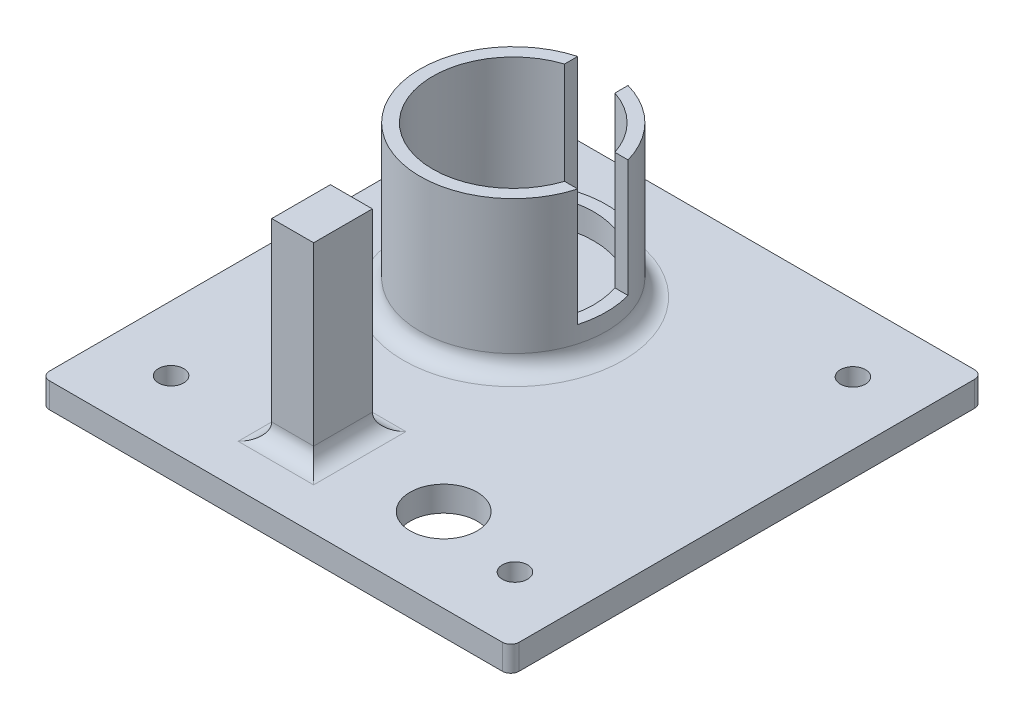
ISO-10303-21;
HEADER;
FILE_DESCRIPTION(('STEP AP214'),'2;1');
FILE_NAME('part.step','',(''),(''),'','','');
FILE_SCHEMA(('AUTOMOTIVE_DESIGN { 1 0 10303 214 1 1 1 1 }'));
ENDSEC;
DATA;
#1=APPLICATION_CONTEXT('core data for automotive mechanical design processes');
#2=APPLICATION_PROTOCOL_DEFINITION('international standard','automotive_design',2000,#1);
#3=PRODUCT_CONTEXT('',#1,'mechanical');
#4=PRODUCT('Part','Part','',(#3));
#5=PRODUCT_RELATED_PRODUCT_CATEGORY('part','',(#4));
#6=PRODUCT_DEFINITION_FORMATION('','',#4);
#7=PRODUCT_DEFINITION_CONTEXT('part definition',#1,'design');
#8=PRODUCT_DEFINITION('design','',#6,#7);
#9=PRODUCT_DEFINITION_SHAPE('','',#8);
#10=(LENGTH_UNIT() NAMED_UNIT(*) SI_UNIT(.MILLI.,.METRE.));
#11=(NAMED_UNIT(*) PLANE_ANGLE_UNIT() SI_UNIT($,.RADIAN.));
#12=(NAMED_UNIT(*) SI_UNIT($,.STERADIAN.) SOLID_ANGLE_UNIT());
#13=UNCERTAINTY_MEASURE_WITH_UNIT(LENGTH_MEASURE(1.E-05),#10,'distance_accuracy_value','');
#14=(GEOMETRIC_REPRESENTATION_CONTEXT(3) GLOBAL_UNCERTAINTY_ASSIGNED_CONTEXT((#13)) GLOBAL_UNIT_ASSIGNED_CONTEXT((#10,
#11,#12)) REPRESENTATION_CONTEXT('',''));
#15=CARTESIAN_POINT('',(0.,0.,0.));
#16=DIRECTION('',(0.,0.,1.));
#17=DIRECTION('',(1.,0.,0.));
#18=AXIS2_PLACEMENT_3D('',#15,#16,#17);
#19=CARTESIAN_POINT('',(186.220436476095,8.44100589043276,101.769362794441));
#20=DIRECTION('',(0.,1.,0.));
#21=DIRECTION('',(0.,0.,1.));
#22=AXIS2_PLACEMENT_3D('',#19,#20,#21);
#23=PLANE('',#22);
#24=DIRECTION('',(0.,0.,1.));
#25=VECTOR('',#24,1.);
#26=CARTESIAN_POINT('',(149.720436476095,8.44100589043276,101.769362794441));
#27=LINE('',#26,#25);
#28=CARTESIAN_POINT('',(149.720436476095,8.44100589043276,97.7693627944412));
#29=VERTEX_POINT('',#28);
#30=CARTESIAN_POINT('',(149.720436476095,8.44100589043276,86.7693627944412));
#31=VERTEX_POINT('',#30);
#32=EDGE_CURVE('E362',#29,#31,#27,.F.);
#33=ORIENTED_EDGE('',*,*,#32,.T.);
#34=DIRECTION('',(-1.,0.,0.));
#35=VECTOR('',#34,1.);
#36=CARTESIAN_POINT('',(186.220436476095,8.44100589043276,86.7693627944412));
#37=LINE('',#36,#35);
#38=CARTESIAN_POINT('',(158.720436476095,8.44100589043276,86.7693627944412));
#39=VERTEX_POINT('',#38);
#40=EDGE_CURVE('E368',#31,#39,#37,.F.);
#41=ORIENTED_EDGE('',*,*,#40,.T.);
#42=DIRECTION('',(0.,0.,-1.));
#43=VECTOR('',#42,1.);
#44=CARTESIAN_POINT('',(158.720436476095,8.44100589043276,101.769362794441));
#45=LINE('',#44,#43);
#46=CARTESIAN_POINT('',(158.720436476095,8.44100589043276,97.7693627944412));
#47=VERTEX_POINT('',#46);
#48=EDGE_CURVE('E366',#39,#47,#45,.F.);
#49=ORIENTED_EDGE('',*,*,#48,.T.);
#50=DIRECTION('',(1.,0.,0.));
#51=VECTOR('',#50,1.);
#52=CARTESIAN_POINT('',(186.220436476095,8.44100589043276,97.7693627944413));
#53=LINE('',#52,#51);
#54=EDGE_CURVE('E364',#47,#29,#53,.F.);
#55=ORIENTED_EDGE('',*,*,#54,.T.);
#56=EDGE_LOOP('',(#33,#41,#49,#55));
#57=FACE_BOUND('',#56,.T.);
#58=CARTESIAN_POINT('',(179.720436476096,8.44100589043275,54.4693627944416));
#59=DIRECTION('',(0.,1.,0.));
#60=DIRECTION('',(0.,0.,1.));
#61=AXIS2_PLACEMENT_3D('',#58,#59,#60);
#62=CIRCLE('',#61,1.5);
#63=CARTESIAN_POINT('',(179.720436476096,8.44100589043275,55.9693627944416));
#64=VERTEX_POINT('',#63);
#65=EDGE_CURVE('E215',#64,#64,#62,.T.);
#66=ORIENTED_EDGE('',*,*,#65,.F.);
#67=EDGE_LOOP('',(#66));
#68=FACE_BOUND('',#67,.T.);
#69=CARTESIAN_POINT('',(179.720436476096,8.44100589043276,94.7693627944417));
#70=DIRECTION('',(0.,1.,0.));
#71=DIRECTION('',(0.,0.,1.));
#72=AXIS2_PLACEMENT_3D('',#69,#70,#71);
#73=CIRCLE('',#72,1.5);
#74=CARTESIAN_POINT('',(179.720436476096,8.44100589043276,96.2693627944417));
#75=VERTEX_POINT('',#74);
#76=EDGE_CURVE('E223',#75,#75,#73,.T.);
#77=ORIENTED_EDGE('',*,*,#76,.F.);
#78=EDGE_LOOP('',(#77));
#79=FACE_BOUND('',#78,.T.);
#80=CARTESIAN_POINT('',(138.952841808409,8.44100589043276,95.0031089267494));
#81=DIRECTION('',(0.,1.,0.));
#82=DIRECTION('',(0.,0.,1.));
#83=AXIS2_PLACEMENT_3D('',#80,#81,#82);
#84=CIRCLE('',#83,1.5);
#85=CARTESIAN_POINT('',(138.952841808409,8.44100589043276,96.5031089267494));
#86=VERTEX_POINT('',#85);
#87=EDGE_CURVE('E206',#86,#86,#84,.T.);
#88=ORIENTED_EDGE('',*,*,#87,.F.);
#89=EDGE_LOOP('',(#88));
#90=FACE_BOUND('',#89,.T.);
#91=CARTESIAN_POINT('',(169.220436476095,8.44100589043276,92.7693627944412));
#92=DIRECTION('',(0.,1.,0.));
#93=DIRECTION('',(0.,0.,1.));
#94=AXIS2_PLACEMENT_3D('',#91,#92,#93);
#95=CIRCLE('',#94,3.99999999999999);
#96=CARTESIAN_POINT('',(169.220436476095,8.44100589043276,96.7693627944412));
#97=VERTEX_POINT('',#96);
#98=EDGE_CURVE('E222',#97,#97,#95,.T.);
#99=ORIENTED_EDGE('',*,*,#98,.F.);
#100=EDGE_LOOP('',(#99));
#101=FACE_BOUND('',#100,.T.);
#102=CARTESIAN_POINT('',(151.220436476095,8.44100589043275,66.4693627944412));
#103=DIRECTION('',(0.,1.,0.));
#104=DIRECTION('',(0.,0.,1.));
#105=AXIS2_PLACEMENT_3D('',#102,#103,#104);
#106=CIRCLE('',#105,13.1);
#107=CARTESIAN_POINT('',(151.220436476095,8.44100589043276,79.5693627944412));
#108=VERTEX_POINT('',#107);
#109=EDGE_CURVE('E339',#108,#108,#106,.F.);
#110=ORIENTED_EDGE('',*,*,#109,.T.);
#111=EDGE_LOOP('',(#110));
#112=FACE_BOUND('',#111,.T.);
#113=CARTESIAN_POINT('',(186.220436476095,8.44100589043276,101.769362794441));
#114=DIRECTION('',(0.,1.,0.));
#115=DIRECTION('',(0.,0.,1.));
#116=AXIS2_PLACEMENT_3D('',#113,#114,#115);
#117=CIRCLE('',#116,1.);
#118=CARTESIAN_POINT('',(186.220436476095,8.44100589043276,102.769362794441));
#119=VERTEX_POINT('',#118);
#120=CARTESIAN_POINT('',(187.220436476095,8.44100589043276,101.769362794441));
#121=VERTEX_POINT('',#120);
#122=EDGE_CURVE('E278',#119,#121,#117,.T.);
#123=ORIENTED_EDGE('',*,*,#122,.T.);
#124=DIRECTION('',(0.,0.,-1.));
#125=VECTOR('',#124,1.);
#126=CARTESIAN_POINT('',(187.220436476095,8.44100589043276,101.769362794441));
#127=LINE('',#126,#125);
#128=CARTESIAN_POINT('',(187.220436476095,8.44100589043275,47.4693627944412));
#129=VERTEX_POINT('',#128);
#130=EDGE_CURVE('E281',#121,#129,#127,.T.);
#131=ORIENTED_EDGE('',*,*,#130,.T.);
#132=CARTESIAN_POINT('',(186.220436476095,8.44100589043275,47.4693627944412));
#133=DIRECTION('',(0.,1.,0.));
#134=DIRECTION('',(0.,0.,1.));
#135=AXIS2_PLACEMENT_3D('',#132,#133,#134);
#136=CIRCLE('',#135,1.);
#137=CARTESIAN_POINT('',(186.220436476095,8.44100589043275,46.4693627944412));
#138=VERTEX_POINT('',#137);
#139=EDGE_CURVE('E284',#129,#138,#136,.T.);
#140=ORIENTED_EDGE('',*,*,#139,.T.);
#141=DIRECTION('',(-1.,0.,0.));
#142=VECTOR('',#141,1.);
#143=CARTESIAN_POINT('',(186.220436476095,8.44100589043274,46.4693627944412));
#144=LINE('',#143,#142);
#145=CARTESIAN_POINT('',(132.220436476095,8.44100589043274,46.4693627944412));
#146=VERTEX_POINT('',#145);
#147=EDGE_CURVE('E286',#138,#146,#144,.T.);
#148=ORIENTED_EDGE('',*,*,#147,.T.);
#149=CARTESIAN_POINT('',(132.220436476095,8.44100589043274,47.4693627944412));
#150=DIRECTION('',(0.,1.,0.));
#151=DIRECTION('',(0.,0.,1.));
#152=AXIS2_PLACEMENT_3D('',#149,#150,#151);
#153=CIRCLE('',#152,1.);
#154=CARTESIAN_POINT('',(131.220436476095,8.44100589043274,47.4693627944412));
#155=VERTEX_POINT('',#154);
#156=EDGE_CURVE('E288',#146,#155,#153,.T.);
#157=ORIENTED_EDGE('',*,*,#156,.T.);
#158=DIRECTION('',(0.,0.,1.));
#159=VECTOR('',#158,1.);
#160=CARTESIAN_POINT('',(131.220436476095,8.44100589043274,47.4693627944412));
#161=LINE('',#160,#159);
#162=CARTESIAN_POINT('',(131.220436476095,8.44100589043276,101.769362794441));
#163=VERTEX_POINT('',#162);
#164=EDGE_CURVE('E290',#155,#163,#161,.T.);
#165=ORIENTED_EDGE('',*,*,#164,.T.);
#166=CARTESIAN_POINT('',(132.220436476095,8.44100589043276,101.769362794441));
#167=DIRECTION('',(0.,1.,0.));
#168=DIRECTION('',(0.,0.,1.));
#169=AXIS2_PLACEMENT_3D('',#166,#167,#168);
#170=CIRCLE('',#169,1.);
#171=CARTESIAN_POINT('',(132.220436476095,8.44100589043276,102.769362794441));
#172=VERTEX_POINT('',#171);
#173=EDGE_CURVE('E292',#163,#172,#170,.T.);
#174=ORIENTED_EDGE('',*,*,#173,.T.);
#175=DIRECTION('',(1.,0.,0.));
#176=VECTOR('',#175,1.);
#177=CARTESIAN_POINT('',(132.220436476095,8.44100589043276,102.769362794441));
#178=LINE('',#177,#176);
#179=EDGE_CURVE('E294',#172,#119,#178,.T.);
#180=ORIENTED_EDGE('',*,*,#179,.T.);
#181=EDGE_LOOP('',(#123,#131,#140,#148,#157,#165,#174,#180));
#182=FACE_BOUND('',#181,.T.);
#183=ADVANCED_FACE('F33',(#57,#68,#79,#90,#101,#112,#182),#23,.T.);
#184=CARTESIAN_POINT('',(151.220436476095,26.4410058904327,66.4693627944412));
#185=DIRECTION('',(0.,1.,0.));
#186=DIRECTION('',(0.,0.,1.));
#187=AXIS2_PLACEMENT_3D('',#184,#185,#186);
#188=PLANE('',#187);
#189=DIRECTION('',(1.,0.,0.));
#190=VECTOR('',#189,1.);
#191=CARTESIAN_POINT('',(166.220436476095,26.4410058904327,69.4693627944412));
#192=LINE('',#191,#190);
#193=CARTESIAN_POINT('',(160.339646968238,26.4410058904327,69.4693627944412));
#194=VERTEX_POINT('',#193);
#195=CARTESIAN_POINT('',(161.90734435443,26.4410058904327,69.4693627944412));
#196=VERTEX_POINT('',#195);
#197=EDGE_CURVE('E236',#194,#196,#192,.T.);
#198=ORIENTED_EDGE('',*,*,#197,.F.);
#199=CARTESIAN_POINT('',(151.220436476095,26.4410058904327,66.4693627944412));
#200=DIRECTION('',(0.,1.,0.));
#201=DIRECTION('',(0.,0.,1.));
#202=AXIS2_PLACEMENT_3D('',#199,#200,#201);
#203=CIRCLE('',#202,9.6);
#204=CARTESIAN_POINT('',(148.220436476095,26.4410058904327,57.3501523022988));
#205=VERTEX_POINT('',#204);
#206=EDGE_CURVE('E267',#205,#194,#203,.T.);
#207=ORIENTED_EDGE('',*,*,#206,.F.);
#208=DIRECTION('',(0.,0.,1.));
#209=VECTOR('',#208,1.);
#210=CARTESIAN_POINT('',(148.220436476095,26.4410058904327,70.4693627944412));
#211=LINE('',#210,#209);
#212=CARTESIAN_POINT('',(148.220436476095,26.4410058904327,55.7824549161071));
#213=VERTEX_POINT('',#212);
#214=EDGE_CURVE('E247',#213,#205,#211,.T.);
#215=ORIENTED_EDGE('',*,*,#214,.F.);
#216=CARTESIAN_POINT('',(151.220436476095,26.4410058904327,66.4693627944412));
#217=DIRECTION('',(0.,1.,0.));
#218=DIRECTION('',(0.,0.,1.));
#219=AXIS2_PLACEMENT_3D('',#216,#217,#218);
#220=CIRCLE('',#219,11.1);
#221=EDGE_CURVE('E271',#213,#196,#220,.T.);
#222=ORIENTED_EDGE('',*,*,#221,.T.);
#223=EDGE_LOOP('',(#198,#207,#215,#222));
#224=FACE_BOUND('',#223,.T.);
#225=ADVANCED_FACE('F411',(#224),#188,.T.);
#226=CARTESIAN_POINT('',(186.220436476095,8.44100589043276,101.769362794441));
#227=DIRECTION('',(0.,-1.,0.));
#228=DIRECTION('',(0.,0.,-1.));
#229=AXIS2_PLACEMENT_3D('',#226,#227,#228);
#230=CYLINDRICAL_SURFACE('',#229,1.);
#231=CARTESIAN_POINT('',(186.220436476095,5.44100589043276,101.769362794441));
#232=DIRECTION('',(0.,1.,0.));
#233=DIRECTION('',(0.,0.,1.));
#234=AXIS2_PLACEMENT_3D('',#231,#232,#233);
#235=CIRCLE('',#234,1.);
#236=CARTESIAN_POINT('',(186.220436476095,5.44100589043276,102.769362794441));
#237=VERTEX_POINT('',#236);
#238=CARTESIAN_POINT('',(187.220436476095,5.44100589043276,101.769362794441));
#239=VERTEX_POINT('',#238);
#240=EDGE_CURVE('E297',#237,#239,#235,.T.);
#241=ORIENTED_EDGE('',*,*,#240,.T.);
#242=DIRECTION('',(0.,-1.,0.));
#243=VECTOR('',#242,1.);
#244=CARTESIAN_POINT('',(187.220436476095,8.44100589043276,101.769362794441));
#245=LINE('',#244,#243);
#246=EDGE_CURVE('E333',#121,#239,#245,.T.);
#247=ORIENTED_EDGE('',*,*,#246,.F.);
#248=ORIENTED_EDGE('',*,*,#122,.F.);
#249=DIRECTION('',(0.,-1.,0.));
#250=VECTOR('',#249,1.);
#251=CARTESIAN_POINT('',(186.220436476095,8.44100589043276,102.769362794441));
#252=LINE('',#251,#250);
#253=EDGE_CURVE('E296',#119,#237,#252,.T.);
#254=ORIENTED_EDGE('',*,*,#253,.T.);
#255=EDGE_LOOP('',(#241,#247,#248,#254));
#256=FACE_BOUND('',#255,.T.);
#257=ADVANCED_FACE('F416',(#256),#230,.T.);
#258=CARTESIAN_POINT('',(187.220436476095,8.44100589043276,101.769362794441));
#259=DIRECTION('',(-1.,0.,0.));
#260=DIRECTION('',(0.,-1.,0.));
#261=AXIS2_PLACEMENT_3D('',#258,#259,#260);
#262=PLANE('',#261);
#263=DIRECTION('',(0.,0.,-1.));
#264=VECTOR('',#263,1.);
#265=CARTESIAN_POINT('',(187.220436476095,5.44100589043276,101.769362794441));
#266=LINE('',#265,#264);
#267=CARTESIAN_POINT('',(187.220436476095,5.44100589043274,47.4693627944412));
#268=VERTEX_POINT('',#267);
#269=EDGE_CURVE('E300',#239,#268,#266,.T.);
#270=ORIENTED_EDGE('',*,*,#269,.T.);
#271=DIRECTION('',(0.,-1.,0.));
#272=VECTOR('',#271,1.);
#273=CARTESIAN_POINT('',(187.220436476095,8.44100589043275,47.4693627944412));
#274=LINE('',#273,#272);
#275=EDGE_CURVE('E330',#129,#268,#274,.T.);
#276=ORIENTED_EDGE('',*,*,#275,.F.);
#277=ORIENTED_EDGE('',*,*,#130,.F.);
#278=ORIENTED_EDGE('',*,*,#246,.T.);
#279=EDGE_LOOP('',(#270,#276,#277,#278));
#280=FACE_BOUND('',#279,.T.);
#281=ADVANCED_FACE('F450',(#280),#262,.F.);
#282=CARTESIAN_POINT('',(186.220436476095,8.44100589043275,47.4693627944412));
#283=DIRECTION('',(0.,-1.,0.));
#284=DIRECTION('',(0.,0.,-1.));
#285=AXIS2_PLACEMENT_3D('',#282,#283,#284);
#286=CYLINDRICAL_SURFACE('',#285,1.);
#287=CARTESIAN_POINT('',(186.220436476095,5.44100589043274,47.4693627944412));
#288=DIRECTION('',(0.,1.,0.));
#289=DIRECTION('',(0.,0.,1.));
#290=AXIS2_PLACEMENT_3D('',#287,#288,#289);
#291=CIRCLE('',#290,1.);
#292=CARTESIAN_POINT('',(186.220436476095,5.44100589043274,46.4693627944412));
#293=VERTEX_POINT('',#292);
#294=EDGE_CURVE('E302',#268,#293,#291,.T.);
#295=ORIENTED_EDGE('',*,*,#294,.T.);
#296=DIRECTION('',(0.,-1.,0.));
#297=VECTOR('',#296,1.);
#298=CARTESIAN_POINT('',(186.220436476095,8.44100589043275,46.4693627944412));
#299=LINE('',#298,#297);
#300=EDGE_CURVE('E327',#138,#293,#299,.T.);
#301=ORIENTED_EDGE('',*,*,#300,.F.);
#302=ORIENTED_EDGE('',*,*,#139,.F.);
#303=ORIENTED_EDGE('',*,*,#275,.T.);
#304=EDGE_LOOP('',(#295,#301,#302,#303));
#305=FACE_BOUND('',#304,.T.);
#306=ADVANCED_FACE('F446',(#305),#286,.T.);
#307=CARTESIAN_POINT('',(186.220436476095,8.44100589043274,46.4693627944412));
#308=DIRECTION('',(0.,0.,1.));
#309=DIRECTION('',(0.,-1.,0.));
#310=AXIS2_PLACEMENT_3D('',#307,#308,#309);
#311=PLANE('',#310);
#312=DIRECTION('',(-1.,0.,0.));
#313=VECTOR('',#312,1.);
#314=CARTESIAN_POINT('',(186.220436476095,5.44100589043274,46.4693627944412));
#315=LINE('',#314,#313);
#316=CARTESIAN_POINT('',(132.220436476095,5.44100589043274,46.4693627944412));
#317=VERTEX_POINT('',#316);
#318=EDGE_CURVE('E304',#293,#317,#315,.T.);
#319=ORIENTED_EDGE('',*,*,#318,.T.);
#320=DIRECTION('',(0.,-1.,0.));
#321=VECTOR('',#320,1.);
#322=CARTESIAN_POINT('',(132.220436476095,8.44100589043274,46.4693627944412));
#323=LINE('',#322,#321);
#324=EDGE_CURVE('E324',#146,#317,#323,.T.);
#325=ORIENTED_EDGE('',*,*,#324,.F.);
#326=ORIENTED_EDGE('',*,*,#147,.F.);
#327=ORIENTED_EDGE('',*,*,#300,.T.);
#328=EDGE_LOOP('',(#319,#325,#326,#327));
#329=FACE_BOUND('',#328,.T.);
#330=ADVANCED_FACE('F442',(#329),#311,.F.);
#331=CARTESIAN_POINT('',(132.220436476095,8.44100589043274,47.4693627944412));
#332=DIRECTION('',(0.,-1.,0.));
#333=DIRECTION('',(0.,0.,-1.));
#334=AXIS2_PLACEMENT_3D('',#331,#332,#333);
#335=CYLINDRICAL_SURFACE('',#334,1.);
#336=CARTESIAN_POINT('',(132.220436476095,5.44100589043274,47.4693627944412));
#337=DIRECTION('',(0.,1.,0.));
#338=DIRECTION('',(0.,0.,1.));
#339=AXIS2_PLACEMENT_3D('',#336,#337,#338);
#340=CIRCLE('',#339,1.);
#341=CARTESIAN_POINT('',(131.220436476095,5.44100589043274,47.4693627944412));
#342=VERTEX_POINT('',#341);
#343=EDGE_CURVE('E306',#317,#342,#340,.T.);
#344=ORIENTED_EDGE('',*,*,#343,.T.);
#345=DIRECTION('',(0.,-1.,0.));
#346=VECTOR('',#345,1.);
#347=CARTESIAN_POINT('',(131.220436476095,8.44100589043274,47.4693627944412));
#348=LINE('',#347,#346);
#349=EDGE_CURVE('E321',#155,#342,#348,.T.);
#350=ORIENTED_EDGE('',*,*,#349,.F.);
#351=ORIENTED_EDGE('',*,*,#156,.F.);
#352=ORIENTED_EDGE('',*,*,#324,.T.);
#353=EDGE_LOOP('',(#344,#350,#351,#352));
#354=FACE_BOUND('',#353,.T.);
#355=ADVANCED_FACE('F438',(#354),#335,.T.);
#356=CARTESIAN_POINT('',(131.220436476095,8.44100589043274,47.4693627944412));
#357=DIRECTION('',(1.,0.,0.));
#358=DIRECTION('',(0.,0.,-1.));
#359=AXIS2_PLACEMENT_3D('',#356,#357,#358);
#360=PLANE('',#359);
#361=DIRECTION('',(0.,0.,1.));
#362=VECTOR('',#361,1.);
#363=CARTESIAN_POINT('',(131.220436476095,5.44100589043274,47.4693627944412));
#364=LINE('',#363,#362);
#365=CARTESIAN_POINT('',(131.220436476095,5.44100589043276,101.769362794441));
#366=VERTEX_POINT('',#365);
#367=EDGE_CURVE('E308',#342,#366,#364,.T.);
#368=ORIENTED_EDGE('',*,*,#367,.T.);
#369=DIRECTION('',(0.,-1.,0.));
#370=VECTOR('',#369,1.);
#371=CARTESIAN_POINT('',(131.220436476095,8.44100589043276,101.769362794441));
#372=LINE('',#371,#370);
#373=EDGE_CURVE('E318',#163,#366,#372,.T.);
#374=ORIENTED_EDGE('',*,*,#373,.F.);
#375=ORIENTED_EDGE('',*,*,#164,.F.);
#376=ORIENTED_EDGE('',*,*,#349,.T.);
#377=EDGE_LOOP('',(#368,#374,#375,#376));
#378=FACE_BOUND('',#377,.T.);
#379=ADVANCED_FACE('F434',(#378),#360,.F.);
#380=CARTESIAN_POINT('',(132.220436476095,8.44100589043276,101.769362794441));
#381=DIRECTION('',(0.,-1.,0.));
#382=DIRECTION('',(0.,0.,-1.));
#383=AXIS2_PLACEMENT_3D('',#380,#381,#382);
#384=CYLINDRICAL_SURFACE('',#383,1.);
#385=CARTESIAN_POINT('',(132.220436476095,5.44100589043276,101.769362794441));
#386=DIRECTION('',(0.,1.,0.));
#387=DIRECTION('',(0.,0.,1.));
#388=AXIS2_PLACEMENT_3D('',#385,#386,#387);
#389=CIRCLE('',#388,1.);
#390=CARTESIAN_POINT('',(132.220436476095,5.44100589043276,102.769362794441));
#391=VERTEX_POINT('',#390);
#392=EDGE_CURVE('E310',#366,#391,#389,.T.);
#393=ORIENTED_EDGE('',*,*,#392,.T.);
#394=DIRECTION('',(0.,-1.,0.));
#395=VECTOR('',#394,1.);
#396=CARTESIAN_POINT('',(132.220436476095,8.44100589043276,102.769362794441));
#397=LINE('',#396,#395);
#398=EDGE_CURVE('E315',#172,#391,#397,.T.);
#399=ORIENTED_EDGE('',*,*,#398,.F.);
#400=ORIENTED_EDGE('',*,*,#173,.F.);
#401=ORIENTED_EDGE('',*,*,#373,.T.);
#402=EDGE_LOOP('',(#393,#399,#400,#401));
#403=FACE_BOUND('',#402,.T.);
#404=ADVANCED_FACE('F430',(#403),#384,.T.);
#405=CARTESIAN_POINT('',(132.220436476095,8.44100589043276,102.769362794441));
#406=DIRECTION('',(0.,0.,-1.));
#407=DIRECTION('',(-1.,0.,0.));
#408=AXIS2_PLACEMENT_3D('',#405,#406,#407);
#409=PLANE('',#408);
#410=DIRECTION('',(1.,0.,0.));
#411=VECTOR('',#410,1.);
#412=CARTESIAN_POINT('',(132.220436476095,5.44100589043276,102.769362794441));
#413=LINE('',#412,#411);
#414=EDGE_CURVE('E282',#391,#237,#413,.T.);
#415=ORIENTED_EDGE('',*,*,#414,.T.);
#416=ORIENTED_EDGE('',*,*,#253,.F.);
#417=ORIENTED_EDGE('',*,*,#179,.F.);
#418=ORIENTED_EDGE('',*,*,#398,.T.);
#419=EDGE_LOOP('',(#415,#416,#417,#418));
#420=FACE_BOUND('',#419,.T.);
#421=ADVANCED_FACE('F426',(#420),#409,.F.);
#422=CARTESIAN_POINT('',(186.220436476095,5.44100589043276,101.769362794441));
#423=DIRECTION('',(0.,1.,0.));
#424=DIRECTION('',(0.,0.,1.));
#425=AXIS2_PLACEMENT_3D('',#422,#423,#424);
#426=PLANE('',#425);
#427=CARTESIAN_POINT('',(179.720436476096,5.44100589043275,54.4693627944416));
#428=DIRECTION('',(0.,1.,0.));
#429=DIRECTION('',(0.,0.,1.));
#430=AXIS2_PLACEMENT_3D('',#427,#428,#429);
#431=CIRCLE('',#430,1.5);
#432=CARTESIAN_POINT('',(179.720436476096,5.44100589043275,55.9693627944416));
#433=VERTEX_POINT('',#432);
#434=EDGE_CURVE('E218',#433,#433,#431,.F.);
#435=ORIENTED_EDGE('',*,*,#434,.F.);
#436=EDGE_LOOP('',(#435));
#437=FACE_BOUND('',#436,.T.);
#438=CARTESIAN_POINT('',(179.720436476096,5.44100589043276,94.7693627944417));
#439=DIRECTION('',(0.,1.,0.));
#440=DIRECTION('',(0.,0.,1.));
#441=AXIS2_PLACEMENT_3D('',#438,#439,#440);
#442=CIRCLE('',#441,1.5);
#443=CARTESIAN_POINT('',(179.720436476096,5.44100589043276,96.2693627944417));
#444=VERTEX_POINT('',#443);
#445=EDGE_CURVE('E219',#444,#444,#442,.F.);
#446=ORIENTED_EDGE('',*,*,#445,.F.);
#447=EDGE_LOOP('',(#446));
#448=FACE_BOUND('',#447,.T.);
#449=CARTESIAN_POINT('',(138.952841808409,5.44100589043276,95.0031089267494));
#450=DIRECTION('',(0.,1.,0.));
#451=DIRECTION('',(0.,0.,1.));
#452=AXIS2_PLACEMENT_3D('',#449,#450,#451);
#453=CIRCLE('',#452,1.5);
#454=CARTESIAN_POINT('',(138.952841808409,5.44100589043276,96.5031089267494));
#455=VERTEX_POINT('',#454);
#456=EDGE_CURVE('E209',#455,#455,#453,.F.);
#457=ORIENTED_EDGE('',*,*,#456,.F.);
#458=EDGE_LOOP('',(#457));
#459=FACE_BOUND('',#458,.T.);
#460=CARTESIAN_POINT('',(169.220436476095,5.44100589043276,92.7693627944412));
#461=DIRECTION('',(0.,1.,0.));
#462=DIRECTION('',(0.,0.,1.));
#463=AXIS2_PLACEMENT_3D('',#460,#461,#462);
#464=CIRCLE('',#463,3.99999999999999);
#465=CARTESIAN_POINT('',(169.220436476095,5.44100589043276,96.7693627944412));
#466=VERTEX_POINT('',#465);
#467=EDGE_CURVE('E232',#466,#466,#464,.T.);
#468=ORIENTED_EDGE('',*,*,#467,.T.);
#469=EDGE_LOOP('',(#468));
#470=FACE_BOUND('',#469,.T.);
#471=ORIENTED_EDGE('',*,*,#240,.F.);
#472=ORIENTED_EDGE('',*,*,#414,.F.);
#473=ORIENTED_EDGE('',*,*,#392,.F.);
#474=ORIENTED_EDGE('',*,*,#367,.F.);
#475=ORIENTED_EDGE('',*,*,#343,.F.);
#476=ORIENTED_EDGE('',*,*,#318,.F.);
#477=ORIENTED_EDGE('',*,*,#294,.F.);
#478=ORIENTED_EDGE('',*,*,#269,.F.);
#479=EDGE_LOOP('',(#471,#472,#473,#474,#475,#476,#477,#478));
#480=FACE_BOUND('',#479,.T.);
#481=ADVANCED_FACE('F423',(#437,#448,#459,#470,#480),#426,.F.);
#482=CARTESIAN_POINT('',(151.220436476095,26.4410058904327,66.4693627944412));
#483=DIRECTION('',(0.,-1.,0.));
#484=DIRECTION('',(0.,0.,-1.));
#485=AXIS2_PLACEMENT_3D('',#482,#483,#484);
#486=CYLINDRICAL_SURFACE('',#485,11.1);
#487=CARTESIAN_POINT('',(151.220436476095,10.4410058904327,66.4693627944412));
#488=DIRECTION('',(0.,1.,0.));
#489=DIRECTION('',(0.,0.,1.));
#490=AXIS2_PLACEMENT_3D('',#487,#488,#489);
#491=CIRCLE('',#490,11.1);
#492=CARTESIAN_POINT('',(151.220436476095,10.4410058904328,77.5693627944412));
#493=VERTEX_POINT('',#492);
#494=EDGE_CURVE('E336',#493,#493,#491,.T.);
#495=ORIENTED_EDGE('',*,*,#494,.T.);
#496=EDGE_LOOP('',(#495));
#497=FACE_BOUND('',#496,.T.);
#498=CARTESIAN_POINT('',(151.220436476095,12.4410058904327,66.4693627944412));
#499=DIRECTION('',(0.,1.,0.));
#500=DIRECTION('',(0.,0.,1.));
#501=AXIS2_PLACEMENT_3D('',#498,#499,#500);
#502=CIRCLE('',#501,11.1);
#503=CARTESIAN_POINT('',(161.90734435443,12.4410058904327,69.4693627944412));
#504=VERTEX_POINT('',#503);
#505=CARTESIAN_POINT('',(161.90734435443,12.4410058904327,63.4693627944412));
#506=VERTEX_POINT('',#505);
#507=EDGE_CURVE('E259',#504,#506,#502,.T.);
#508=ORIENTED_EDGE('',*,*,#507,.F.);
#509=DIRECTION('',(0.,-1.,0.));
#510=VECTOR('',#509,1.);
#511=CARTESIAN_POINT('',(161.90734435443,26.4410058904327,69.4693627944412));
#512=LINE('',#511,#510);
#513=EDGE_CURVE('E264',#504,#196,#512,.F.);
#514=ORIENTED_EDGE('',*,*,#513,.T.);
#515=ORIENTED_EDGE('',*,*,#221,.F.);
#516=DIRECTION('',(0.,-1.,0.));
#517=VECTOR('',#516,1.);
#518=CARTESIAN_POINT('',(148.220436476095,26.4410058904327,55.7824549161071));
#519=LINE('',#518,#517);
#520=CARTESIAN_POINT('',(148.220436476095,12.4410058904327,55.7824549161071));
#521=VERTEX_POINT('',#520);
#522=EDGE_CURVE('E253',#213,#521,#519,.T.);
#523=ORIENTED_EDGE('',*,*,#522,.T.);
#524=CARTESIAN_POINT('',(151.220436476095,12.4410058904327,66.4693627944412));
#525=DIRECTION('',(0.,1.,0.));
#526=DIRECTION('',(0.,0.,1.));
#527=AXIS2_PLACEMENT_3D('',#524,#525,#526);
#528=CIRCLE('',#527,11.1);
#529=CARTESIAN_POINT('',(154.220436476095,12.4410058904327,55.7824549161071));
#530=VERTEX_POINT('',#529);
#531=EDGE_CURVE('E239',#530,#521,#528,.T.);
#532=ORIENTED_EDGE('',*,*,#531,.F.);
#533=DIRECTION('',(0.,-1.,0.));
#534=VECTOR('',#533,1.);
#535=CARTESIAN_POINT('',(154.220436476095,26.4410058904327,55.7824549161071));
#536=LINE('',#535,#534);
#537=CARTESIAN_POINT('',(154.220436476095,26.4410058904327,55.7824549161071));
#538=VERTEX_POINT('',#537);
#539=EDGE_CURVE('E256',#530,#538,#536,.F.);
#540=ORIENTED_EDGE('',*,*,#539,.T.);
#541=CARTESIAN_POINT('',(161.90734435443,26.4410058904327,63.4693627944412));
#542=VERTEX_POINT('',#541);
#543=EDGE_CURVE('E277',#542,#538,#220,.T.);
#544=ORIENTED_EDGE('',*,*,#543,.F.);
#545=DIRECTION('',(0.,-1.,0.));
#546=VECTOR('',#545,1.);
#547=CARTESIAN_POINT('',(161.90734435443,26.4410058904327,63.4693627944412));
#548=LINE('',#547,#546);
#549=EDGE_CURVE('E261',#542,#506,#548,.T.);
#550=ORIENTED_EDGE('',*,*,#549,.T.);
#551=EDGE_LOOP('',(#508,#514,#515,#523,#532,#540,#544,#550));
#552=FACE_BOUND('',#551,.T.);
#553=ADVANCED_FACE('F422',(#497,#552),#486,.T.);
#554=DIRECTION('',(-1.,0.,0.));
#555=VECTOR('',#554,1.);
#556=CARTESIAN_POINT('',(166.220436476095,26.4410058904327,63.4693627944412));
#557=LINE('',#556,#555);
#558=CARTESIAN_POINT('',(160.339646968238,26.4410058904327,63.4693627944412));
#559=VERTEX_POINT('',#558);
#560=EDGE_CURVE('E240',#542,#559,#557,.T.);
#561=ORIENTED_EDGE('',*,*,#560,.F.);
#562=ORIENTED_EDGE('',*,*,#543,.T.);
#563=DIRECTION('',(0.,0.,-1.));
#564=VECTOR('',#563,1.);
#565=CARTESIAN_POINT('',(154.220436476095,26.4410058904327,70.4693627944412));
#566=LINE('',#565,#564);
#567=CARTESIAN_POINT('',(154.220436476095,26.4410058904327,57.3501523022988));
#568=VERTEX_POINT('',#567);
#569=EDGE_CURVE('E249',#568,#538,#566,.T.);
#570=ORIENTED_EDGE('',*,*,#569,.F.);
#571=EDGE_CURVE('E272',#559,#568,#203,.T.);
#572=ORIENTED_EDGE('',*,*,#571,.F.);
#573=EDGE_LOOP('',(#561,#562,#570,#572));
#574=FACE_BOUND('',#573,.T.);
#575=ADVANCED_FACE('F419',(#574),#188,.T.);
#576=CARTESIAN_POINT('',(151.220436476095,9.44100589043275,66.4693627944412));
#577=DIRECTION('',(0.,1.,0.));
#578=DIRECTION('',(0.,0.,1.));
#579=AXIS2_PLACEMENT_3D('',#576,#577,#578);
#580=CYLINDRICAL_SURFACE('',#579,9.6);
#581=ORIENTED_EDGE('',*,*,#206,.T.);
#582=DIRECTION('',(0.,1.,0.));
#583=VECTOR('',#582,1.);
#584=CARTESIAN_POINT('',(160.339646968238,9.44100589043275,69.4693627944412));
#585=LINE('',#584,#583);
#586=CARTESIAN_POINT('',(160.339646968238,12.4410058904327,69.4693627944412));
#587=VERTEX_POINT('',#586);
#588=EDGE_CURVE('E355',#194,#587,#585,.F.);
#589=ORIENTED_EDGE('',*,*,#588,.T.);
#590=CARTESIAN_POINT('',(151.220436476095,12.4410058904327,66.4693627944412));
#591=DIRECTION('',(0.,1.,0.));
#592=DIRECTION('',(0.,0.,1.));
#593=AXIS2_PLACEMENT_3D('',#590,#591,#592);
#594=CIRCLE('',#593,9.6);
#595=CARTESIAN_POINT('',(160.339646968238,12.4410058904327,63.4693627944412));
#596=VERTEX_POINT('',#595);
#597=EDGE_CURVE('E350',#596,#587,#594,.F.);
#598=ORIENTED_EDGE('',*,*,#597,.F.);
#599=DIRECTION('',(0.,1.,0.));
#600=VECTOR('',#599,1.);
#601=CARTESIAN_POINT('',(160.339646968238,9.44100589043274,63.4693627944412));
#602=LINE('',#601,#600);
#603=EDGE_CURVE('E352',#596,#559,#602,.T.);
#604=ORIENTED_EDGE('',*,*,#603,.T.);
#605=ORIENTED_EDGE('',*,*,#571,.T.);
#606=DIRECTION('',(0.,1.,0.));
#607=VECTOR('',#606,1.);
#608=CARTESIAN_POINT('',(154.220436476095,9.44100589043274,57.3501523022988));
#609=LINE('',#608,#607);
#610=CARTESIAN_POINT('',(154.220436476095,12.4410058904327,57.3501523022988));
#611=VERTEX_POINT('',#610);
#612=EDGE_CURVE('E347',#568,#611,#609,.F.);
#613=ORIENTED_EDGE('',*,*,#612,.T.);
#614=CARTESIAN_POINT('',(151.220436476095,12.4410058904327,66.4693627944412));
#615=DIRECTION('',(0.,1.,0.));
#616=DIRECTION('',(0.,0.,1.));
#617=AXIS2_PLACEMENT_3D('',#614,#615,#616);
#618=CIRCLE('',#617,9.6);
#619=CARTESIAN_POINT('',(148.220436476095,12.4410058904327,57.3501523022988));
#620=VERTEX_POINT('',#619);
#621=EDGE_CURVE('E342',#620,#611,#618,.F.);
#622=ORIENTED_EDGE('',*,*,#621,.F.);
#623=DIRECTION('',(0.,1.,0.));
#624=VECTOR('',#623,1.);
#625=CARTESIAN_POINT('',(148.220436476095,9.44100589043274,57.3501523022988));
#626=LINE('',#625,#624);
#627=EDGE_CURVE('E344',#620,#205,#626,.T.);
#628=ORIENTED_EDGE('',*,*,#627,.T.);
#629=EDGE_LOOP('',(#581,#589,#598,#604,#605,#613,#622,#628));
#630=FACE_BOUND('',#629,.T.);
#631=CARTESIAN_POINT('',(151.220436476095,9.44100589043275,66.4693627944412));
#632=DIRECTION('',(0.,1.,0.));
#633=DIRECTION('',(0.,0.,1.));
#634=AXIS2_PLACEMENT_3D('',#631,#632,#633);
#635=CIRCLE('',#634,9.6);
#636=CARTESIAN_POINT('',(151.220436476095,9.44100589043275,76.0693627944412));
#637=VERTEX_POINT('',#636);
#638=EDGE_CURVE('E268',#637,#637,#635,.T.);
#639=ORIENTED_EDGE('',*,*,#638,.F.);
#640=EDGE_LOOP('',(#639));
#641=FACE_BOUND('',#640,.T.);
#642=ADVANCED_FACE('F557',(#630,#641),#580,.F.);
#643=CARTESIAN_POINT('',(151.220436476095,9.44100589043275,66.4693627944412));
#644=DIRECTION('',(0.,1.,0.));
#645=DIRECTION('',(0.,0.,1.));
#646=AXIS2_PLACEMENT_3D('',#643,#644,#645);
#647=PLANE('',#646);
#648=ORIENTED_EDGE('',*,*,#638,.T.);
#649=EDGE_LOOP('',(#648));
#650=FACE_BOUND('',#649,.T.);
#651=ADVANCED_FACE('F462',(#650),#647,.T.);
#652=CARTESIAN_POINT('',(151.220436476095,10.4410058904327,66.4693627944412));
#653=DIRECTION('',(0.,1.,0.));
#654=DIRECTION('',(0.,0.,1.));
#655=AXIS2_PLACEMENT_3D('',#652,#653,#654);
#656=TOROIDAL_SURFACE('',#655,13.1,2.);
#657=ORIENTED_EDGE('',*,*,#109,.F.);
#658=EDGE_LOOP('',(#657));
#659=FACE_BOUND('',#658,.T.);
#660=ORIENTED_EDGE('',*,*,#494,.F.);
#661=EDGE_LOOP('',(#660));
#662=FACE_BOUND('',#661,.T.);
#663=ADVANCED_FACE('F458',(#659,#662),#656,.F.);
#664=CARTESIAN_POINT('',(154.220436476095,12.4410058904327,70.4693627944412));
#665=DIRECTION('',(1.,0.,0.));
#666=DIRECTION('',(0.,1.,0.));
#667=AXIS2_PLACEMENT_3D('',#664,#665,#666);
#668=PLANE('',#667);
#669=DIRECTION('',(0.,0.,-1.));
#670=VECTOR('',#669,1.);
#671=CARTESIAN_POINT('',(154.220436476095,12.4410058904327,70.4693627944412));
#672=LINE('',#671,#670);
#673=EDGE_CURVE('E244',#611,#530,#672,.T.);
#674=ORIENTED_EDGE('',*,*,#673,.F.);
#675=ORIENTED_EDGE('',*,*,#612,.F.);
#676=ORIENTED_EDGE('',*,*,#569,.T.);
#677=ORIENTED_EDGE('',*,*,#539,.F.);
#678=EDGE_LOOP('',(#674,#675,#676,#677));
#679=FACE_BOUND('',#678,.T.);
#680=ADVANCED_FACE('F461',(#679),#668,.F.);
#681=CARTESIAN_POINT('',(148.220436476095,12.4410058904327,70.4693627944412));
#682=DIRECTION('',(-1.,0.,0.));
#683=DIRECTION('',(0.,0.,1.));
#684=AXIS2_PLACEMENT_3D('',#681,#682,#683);
#685=PLANE('',#684);
#686=ORIENTED_EDGE('',*,*,#214,.T.);
#687=ORIENTED_EDGE('',*,*,#627,.F.);
#688=DIRECTION('',(0.,0.,1.));
#689=VECTOR('',#688,1.);
#690=CARTESIAN_POINT('',(148.220436476095,12.4410058904327,70.4693627944412));
#691=LINE('',#690,#689);
#692=EDGE_CURVE('E242',#521,#620,#691,.T.);
#693=ORIENTED_EDGE('',*,*,#692,.F.);
#694=ORIENTED_EDGE('',*,*,#522,.F.);
#695=EDGE_LOOP('',(#686,#687,#693,#694));
#696=FACE_BOUND('',#695,.T.);
#697=ADVANCED_FACE('F547',(#696),#685,.F.);
#698=CARTESIAN_POINT('',(0.,12.4410058904327,0.));
#699=DIRECTION('',(0.,1.,0.));
#700=DIRECTION('',(0.,0.,1.));
#701=AXIS2_PLACEMENT_3D('',#698,#699,#700);
#702=PLANE('',#701);
#703=ORIENTED_EDGE('',*,*,#531,.T.);
#704=ORIENTED_EDGE('',*,*,#692,.T.);
#705=ORIENTED_EDGE('',*,*,#621,.T.);
#706=ORIENTED_EDGE('',*,*,#673,.T.);
#707=EDGE_LOOP('',(#703,#704,#705,#706));
#708=FACE_BOUND('',#707,.T.);
#709=ADVANCED_FACE('F540',(#708),#702,.T.);
#710=CARTESIAN_POINT('',(166.220436476095,12.4410058904327,69.4693627944412));
#711=DIRECTION('',(0.,0.,1.));
#712=DIRECTION('',(0.,-1.,0.));
#713=AXIS2_PLACEMENT_3D('',#710,#711,#712);
#714=PLANE('',#713);
#715=DIRECTION('',(1.,0.,0.));
#716=VECTOR('',#715,1.);
#717=CARTESIAN_POINT('',(166.220436476095,12.4410058904327,69.4693627944412));
#718=LINE('',#717,#716);
#719=EDGE_CURVE('E235',#587,#504,#718,.T.);
#720=ORIENTED_EDGE('',*,*,#719,.F.);
#721=ORIENTED_EDGE('',*,*,#588,.F.);
#722=ORIENTED_EDGE('',*,*,#197,.T.);
#723=ORIENTED_EDGE('',*,*,#513,.F.);
#724=EDGE_LOOP('',(#720,#721,#722,#723));
#725=FACE_BOUND('',#724,.T.);
#726=ADVANCED_FACE('F537',(#725),#714,.F.);
#727=CARTESIAN_POINT('',(166.220436476095,12.4410058904327,63.4693627944412));
#728=DIRECTION('',(0.,0.,-1.));
#729=DIRECTION('',(0.,1.,0.));
#730=AXIS2_PLACEMENT_3D('',#727,#728,#729);
#731=PLANE('',#730);
#732=ORIENTED_EDGE('',*,*,#560,.T.);
#733=ORIENTED_EDGE('',*,*,#603,.F.);
#734=DIRECTION('',(-1.,0.,0.));
#735=VECTOR('',#734,1.);
#736=CARTESIAN_POINT('',(166.220436476095,12.4410058904327,63.4693627944412));
#737=LINE('',#736,#735);
#738=EDGE_CURVE('E233',#506,#596,#737,.T.);
#739=ORIENTED_EDGE('',*,*,#738,.F.);
#740=ORIENTED_EDGE('',*,*,#549,.F.);
#741=EDGE_LOOP('',(#732,#733,#739,#740));
#742=FACE_BOUND('',#741,.T.);
#743=ADVANCED_FACE('F535',(#742),#731,.F.);
#744=CARTESIAN_POINT('',(0.,12.4410058904327,0.));
#745=DIRECTION('',(0.,1.,0.));
#746=DIRECTION('',(0.,0.,1.));
#747=AXIS2_PLACEMENT_3D('',#744,#745,#746);
#748=PLANE('',#747);
#749=ORIENTED_EDGE('',*,*,#507,.T.);
#750=ORIENTED_EDGE('',*,*,#738,.T.);
#751=ORIENTED_EDGE('',*,*,#597,.T.);
#752=ORIENTED_EDGE('',*,*,#719,.T.);
#753=EDGE_LOOP('',(#749,#750,#751,#752));
#754=FACE_BOUND('',#753,.T.);
#755=ADVANCED_FACE('F531',(#754),#748,.T.);
#756=CARTESIAN_POINT('',(169.220436476095,4.44100589043276,92.7693627944412));
#757=DIRECTION('',(0.,1.,0.));
#758=DIRECTION('',(0.,0.,1.));
#759=AXIS2_PLACEMENT_3D('',#756,#757,#758);
#760=CYLINDRICAL_SURFACE('',#759,3.99999999999999);
#761=ORIENTED_EDGE('',*,*,#98,.T.);
#762=EDGE_LOOP('',(#761));
#763=FACE_BOUND('',#762,.T.);
#764=ORIENTED_EDGE('',*,*,#467,.F.);
#765=EDGE_LOOP('',(#764));
#766=FACE_BOUND('',#765,.T.);
#767=ADVANCED_FACE('F527',(#763,#766),#760,.F.);
#768=CARTESIAN_POINT('',(138.952841808409,5.44000589043274,95.0031089267494));
#769=DIRECTION('',(0.,1.,0.));
#770=DIRECTION('',(0.,0.,1.));
#771=AXIS2_PLACEMENT_3D('',#768,#769,#770);
#772=CYLINDRICAL_SURFACE('',#771,1.5);
#773=ORIENTED_EDGE('',*,*,#87,.T.);
#774=EDGE_LOOP('',(#773));
#775=FACE_BOUND('',#774,.T.);
#776=ORIENTED_EDGE('',*,*,#456,.T.);
#777=EDGE_LOOP('',(#776));
#778=FACE_BOUND('',#777,.T.);
#779=ADVANCED_FACE('F523',(#775,#778),#772,.F.);
#780=CARTESIAN_POINT('',(179.720436476096,5.44000589043274,94.7693627944417));
#781=DIRECTION('',(0.,1.,0.));
#782=DIRECTION('',(0.,0.,1.));
#783=AXIS2_PLACEMENT_3D('',#780,#781,#782);
#784=CYLINDRICAL_SURFACE('',#783,1.5);
#785=ORIENTED_EDGE('',*,*,#76,.T.);
#786=EDGE_LOOP('',(#785));
#787=FACE_BOUND('',#786,.T.);
#788=ORIENTED_EDGE('',*,*,#445,.T.);
#789=EDGE_LOOP('',(#788));
#790=FACE_BOUND('',#789,.T.);
#791=ADVANCED_FACE('F519',(#787,#790),#784,.F.);
#792=CARTESIAN_POINT('',(179.720436476096,5.44000589043272,54.4693627944416));
#793=DIRECTION('',(0.,1.,0.));
#794=DIRECTION('',(0.,0.,1.));
#795=AXIS2_PLACEMENT_3D('',#792,#793,#794);
#796=CYLINDRICAL_SURFACE('',#795,1.5);
#797=ORIENTED_EDGE('',*,*,#65,.T.);
#798=EDGE_LOOP('',(#797));
#799=FACE_BOUND('',#798,.T.);
#800=ORIENTED_EDGE('',*,*,#434,.T.);
#801=EDGE_LOOP('',(#800));
#802=FACE_BOUND('',#801,.T.);
#803=ADVANCED_FACE('F483',(#799,#802),#796,.F.);
#804=CARTESIAN_POINT('',(156.720436476095,31.4410058904328,88.7693627944412));
#805=DIRECTION('',(-1.,0.,0.));
#806=DIRECTION('',(0.,-1.,0.));
#807=AXIS2_PLACEMENT_3D('',#804,#805,#806);
#808=PLANE('',#807);
#809=DIRECTION('',(0.,-1.,0.));
#810=VECTOR('',#809,1.);
#811=CARTESIAN_POINT('',(156.720436476095,31.4410058904328,95.7693627944412));
#812=LINE('',#811,#810);
#813=CARTESIAN_POINT('',(156.720436476095,31.4410058904328,95.7693627944412));
#814=VERTEX_POINT('',#813);
#815=CARTESIAN_POINT('',(156.720436476095,10.4410058904328,95.7693627944412));
#816=VERTEX_POINT('',#815);
#817=EDGE_CURVE('E398',#814,#816,#812,.T.);
#818=ORIENTED_EDGE('',*,*,#817,.T.);
#819=DIRECTION('',(0.,0.,-1.));
#820=VECTOR('',#819,1.);
#821=CARTESIAN_POINT('',(156.720436476095,10.4410058904328,88.7693627944412));
#822=LINE('',#821,#820);
#823=CARTESIAN_POINT('',(156.720436476095,10.4410058904328,88.7693627944412));
#824=VERTEX_POINT('',#823);
#825=EDGE_CURVE('E205',#816,#824,#822,.T.);
#826=ORIENTED_EDGE('',*,*,#825,.T.);
#827=DIRECTION('',(0.,-1.,0.));
#828=VECTOR('',#827,1.);
#829=CARTESIAN_POINT('',(156.720436476095,31.4410058904328,88.7693627944412));
#830=LINE('',#829,#828);
#831=CARTESIAN_POINT('',(156.720436476095,31.4410058904328,88.7693627944412));
#832=VERTEX_POINT('',#831);
#833=EDGE_CURVE('E189',#832,#824,#830,.T.);
#834=ORIENTED_EDGE('',*,*,#833,.F.);
#835=DIRECTION('',(0.,0.,-1.));
#836=VECTOR('',#835,1.);
#837=CARTESIAN_POINT('',(156.720436476095,31.4410058904328,88.7693627944412));
#838=LINE('',#837,#836);
#839=EDGE_CURVE('E195',#814,#832,#838,.T.);
#840=ORIENTED_EDGE('',*,*,#839,.F.);
#841=EDGE_LOOP('',(#818,#826,#834,#840));
#842=FACE_BOUND('',#841,.T.);
#843=ADVANCED_FACE('F203',(#842),#808,.F.);
#844=CARTESIAN_POINT('',(156.720436476095,31.4410058904328,88.7693627944412));
#845=DIRECTION('',(0.,0.,1.));
#846=DIRECTION('',(0.,-1.,0.));
#847=AXIS2_PLACEMENT_3D('',#844,#845,#846);
#848=PLANE('',#847);
#849=ORIENTED_EDGE('',*,*,#833,.T.);
#850=DIRECTION('',(-1.,0.,0.));
#851=VECTOR('',#850,1.);
#852=CARTESIAN_POINT('',(156.720436476095,10.4410058904328,88.7693627944412));
#853=LINE('',#852,#851);
#854=CARTESIAN_POINT('',(151.720436476095,10.4410058904328,88.7693627944412));
#855=VERTEX_POINT('',#854);
#856=EDGE_CURVE('E358',#824,#855,#853,.T.);
#857=ORIENTED_EDGE('',*,*,#856,.T.);
#858=DIRECTION('',(0.,-1.,0.));
#859=VECTOR('',#858,1.);
#860=CARTESIAN_POINT('',(151.720436476095,31.4410058904328,88.7693627944412));
#861=LINE('',#860,#859);
#862=CARTESIAN_POINT('',(151.720436476095,31.4410058904328,88.7693627944412));
#863=VERTEX_POINT('',#862);
#864=EDGE_CURVE('E191',#863,#855,#861,.T.);
#865=ORIENTED_EDGE('',*,*,#864,.F.);
#866=DIRECTION('',(-1.,0.,0.));
#867=VECTOR('',#866,1.);
#868=CARTESIAN_POINT('',(156.720436476095,31.4410058904328,88.7693627944412));
#869=LINE('',#868,#867);
#870=EDGE_CURVE('E184',#832,#863,#869,.T.);
#871=ORIENTED_EDGE('',*,*,#870,.F.);
#872=EDGE_LOOP('',(#849,#857,#865,#871));
#873=FACE_BOUND('',#872,.T.);
#874=ADVANCED_FACE('F186',(#873),#848,.F.);
#875=CARTESIAN_POINT('',(151.720436476095,31.4410058904328,88.7693627944412));
#876=DIRECTION('',(1.,0.,0.));
#877=DIRECTION('',(0.,1.,0.));
#878=AXIS2_PLACEMENT_3D('',#875,#876,#877);
#879=PLANE('',#878);
#880=ORIENTED_EDGE('',*,*,#864,.T.);
#881=DIRECTION('',(0.,0.,1.));
#882=VECTOR('',#881,1.);
#883=CARTESIAN_POINT('',(151.720436476095,10.4410058904328,88.7693627944412));
#884=LINE('',#883,#882);
#885=CARTESIAN_POINT('',(151.720436476095,10.4410058904328,95.7693627944412));
#886=VERTEX_POINT('',#885);
#887=EDGE_CURVE('E11',#855,#886,#884,.T.);
#888=ORIENTED_EDGE('',*,*,#887,.T.);
#889=DIRECTION('',(0.,-1.,0.));
#890=VECTOR('',#889,1.);
#891=CARTESIAN_POINT('',(151.720436476095,31.4410058904328,95.7693627944412));
#892=LINE('',#891,#890);
#893=CARTESIAN_POINT('',(151.720436476095,31.4410058904328,95.7693627944412));
#894=VERTEX_POINT('',#893);
#895=EDGE_CURVE('E211',#894,#886,#892,.T.);
#896=ORIENTED_EDGE('',*,*,#895,.F.);
#897=DIRECTION('',(0.,0.,1.));
#898=VECTOR('',#897,1.);
#899=CARTESIAN_POINT('',(151.720436476095,31.4410058904328,88.7693627944412));
#900=LINE('',#899,#898);
#901=EDGE_CURVE('E194',#863,#894,#900,.T.);
#902=ORIENTED_EDGE('',*,*,#901,.F.);
#903=EDGE_LOOP('',(#880,#888,#896,#902));
#904=FACE_BOUND('',#903,.T.);
#905=ADVANCED_FACE('F396',(#904),#879,.F.);
#906=CARTESIAN_POINT('',(156.720436476095,31.4410058904328,95.7693627944412));
#907=DIRECTION('',(0.,0.,-1.));
#908=DIRECTION('',(-1.,0.,0.));
#909=AXIS2_PLACEMENT_3D('',#906,#907,#908);
#910=PLANE('',#909);
#911=ORIENTED_EDGE('',*,*,#895,.T.);
#912=DIRECTION('',(1.,0.,0.));
#913=VECTOR('',#912,1.);
#914=CARTESIAN_POINT('',(156.720436476095,10.4410058904328,95.7693627944412));
#915=LINE('',#914,#913);
#916=EDGE_CURVE('E42',#886,#816,#915,.T.);
#917=ORIENTED_EDGE('',*,*,#916,.T.);
#918=ORIENTED_EDGE('',*,*,#817,.F.);
#919=DIRECTION('',(1.,0.,0.));
#920=VECTOR('',#919,1.);
#921=CARTESIAN_POINT('',(156.720436476095,31.4410058904328,95.7693627944412));
#922=LINE('',#921,#920);
#923=EDGE_CURVE('E200',#894,#814,#922,.T.);
#924=ORIENTED_EDGE('',*,*,#923,.F.);
#925=EDGE_LOOP('',(#911,#917,#918,#924));
#926=FACE_BOUND('',#925,.T.);
#927=ADVANCED_FACE('F401',(#926),#910,.F.);
#928=CARTESIAN_POINT('',(0.,31.4410058904327,0.));
#929=DIRECTION('',(0.,-1.,0.));
#930=DIRECTION('',(0.,0.,-1.));
#931=AXIS2_PLACEMENT_3D('',#928,#929,#930);
#932=PLANE('',#931);
#933=ORIENTED_EDGE('',*,*,#839,.T.);
#934=ORIENTED_EDGE('',*,*,#870,.T.);
#935=ORIENTED_EDGE('',*,*,#901,.T.);
#936=ORIENTED_EDGE('',*,*,#923,.T.);
#937=EDGE_LOOP('',(#933,#934,#935,#936));
#938=FACE_BOUND('',#937,.T.);
#939=ADVANCED_FACE('F198',(#938),#932,.F.);
#940=CARTESIAN_POINT('',(156.720436476095,10.4410058904328,97.7693627944412));
#941=DIRECTION('',(1.,0.,0.));
#942=DIRECTION('',(0.,0.,-1.));
#943=AXIS2_PLACEMENT_3D('',#940,#941,#942);
#944=CYLINDRICAL_SURFACE('',#943,2.);
#945=CARTESIAN_POINT('',(149.720436476095,10.4410058904328,97.7693627944412));
#946=DIRECTION('',(0.707106781186547,0.,0.707106781186548));
#947=DIRECTION('',(-0.707106781186548,0.,0.707106781186546));
#948=AXIS2_PLACEMENT_3D('',#945,#946,#947);
#949=ELLIPSE('',#948,2.82842712474619,2.);
#950=EDGE_CURVE('E376',#29,#886,#949,.T.);
#951=ORIENTED_EDGE('',*,*,#950,.F.);
#952=ORIENTED_EDGE('',*,*,#54,.F.);
#953=CARTESIAN_POINT('',(158.720436476095,10.4410058904328,97.7693627944412));
#954=DIRECTION('',(0.707106781186548,0.,-0.707106781186546));
#955=DIRECTION('',(0.707106781186547,0.,0.707106781186548));
#956=AXIS2_PLACEMENT_3D('',#953,#954,#955);
#957=ELLIPSE('',#956,2.82842712474619,2.);
#958=EDGE_CURVE('E37',#816,#47,#957,.F.);
#959=ORIENTED_EDGE('',*,*,#958,.F.);
#960=ORIENTED_EDGE('',*,*,#916,.F.);
#961=EDGE_LOOP('',(#951,#952,#959,#960));
#962=FACE_BOUND('',#961,.T.);
#963=ADVANCED_FACE('F35',(#962),#944,.F.);
#964=CARTESIAN_POINT('',(158.720436476095,10.4410058904328,88.7693627944412));
#965=DIRECTION('',(0.,0.,-1.));
#966=DIRECTION('',(0.,1.,0.));
#967=AXIS2_PLACEMENT_3D('',#964,#965,#966);
#968=CYLINDRICAL_SURFACE('',#967,2.);
#969=ORIENTED_EDGE('',*,*,#958,.T.);
#970=ORIENTED_EDGE('',*,*,#48,.F.);
#971=CARTESIAN_POINT('',(158.720436476095,10.4410058904328,86.7693627944412));
#972=DIRECTION('',(-0.707106781186547,0.,-0.707106781186547));
#973=DIRECTION('',(0.707106781186547,0.,-0.707106781186547));
#974=AXIS2_PLACEMENT_3D('',#971,#972,#973);
#975=ELLIPSE('',#974,2.82842712474619,2.);
#976=EDGE_CURVE('E375',#824,#39,#975,.F.);
#977=ORIENTED_EDGE('',*,*,#976,.F.);
#978=ORIENTED_EDGE('',*,*,#825,.F.);
#979=EDGE_LOOP('',(#969,#970,#977,#978));
#980=FACE_BOUND('',#979,.T.);
#981=ADVANCED_FACE('F385',(#980),#968,.F.);
#982=CARTESIAN_POINT('',(149.720436476095,10.4410058904328,88.7693627944412));
#983=DIRECTION('',(0.,0.,1.));
#984=DIRECTION('',(0.,-1.,0.));
#985=AXIS2_PLACEMENT_3D('',#982,#983,#984);
#986=CYLINDRICAL_SURFACE('',#985,2.);
#987=ORIENTED_EDGE('',*,*,#950,.T.);
#988=ORIENTED_EDGE('',*,*,#887,.F.);
#989=CARTESIAN_POINT('',(149.720436476095,10.4410058904328,86.7693627944412));
#990=DIRECTION('',(-0.707106781186547,0.,0.707106781186547));
#991=DIRECTION('',(0.707106781186547,0.,0.707106781186547));
#992=AXIS2_PLACEMENT_3D('',#989,#990,#991);
#993=ELLIPSE('',#992,2.82842712474619,2.);
#994=EDGE_CURVE('E373',#31,#855,#993,.T.);
#995=ORIENTED_EDGE('',*,*,#994,.F.);
#996=ORIENTED_EDGE('',*,*,#32,.F.);
#997=EDGE_LOOP('',(#987,#988,#995,#996));
#998=FACE_BOUND('',#997,.T.);
#999=ADVANCED_FACE('F395',(#998),#986,.F.);
#1000=CARTESIAN_POINT('',(156.720436476095,10.4410058904328,86.7693627944412));
#1001=DIRECTION('',(-1.,0.,0.));
#1002=DIRECTION('',(0.,-1.,0.));
#1003=AXIS2_PLACEMENT_3D('',#1000,#1001,#1002);
#1004=CYLINDRICAL_SURFACE('',#1003,2.);
#1005=ORIENTED_EDGE('',*,*,#976,.T.);
#1006=ORIENTED_EDGE('',*,*,#40,.F.);
#1007=ORIENTED_EDGE('',*,*,#994,.T.);
#1008=ORIENTED_EDGE('',*,*,#856,.F.);
#1009=EDGE_LOOP('',(#1005,#1006,#1007,#1008));
#1010=FACE_BOUND('',#1009,.T.);
#1011=ADVANCED_FACE('F393',(#1010),#1004,.F.);
#1012=CLOSED_SHELL('',(#183,#225,#257,#281,#306,#330,#355,#379,#404,#421,#481,#553,#575,#642,
#651,#663,#680,#697,#709,#726,#743,#755,#767,#779,#791,#803,#843,#874,#905,#927,#939,#963,#981,
#999,#1011));
#1013=MANIFOLD_SOLID_BREP('B2',#1012);
#1014=ADVANCED_BREP_SHAPE_REPRESENTATION('',(#18,#1013),#14);
#1015=SHAPE_DEFINITION_REPRESENTATION(#9,#1014);
ENDSEC;
END-ISO-10303-21;
